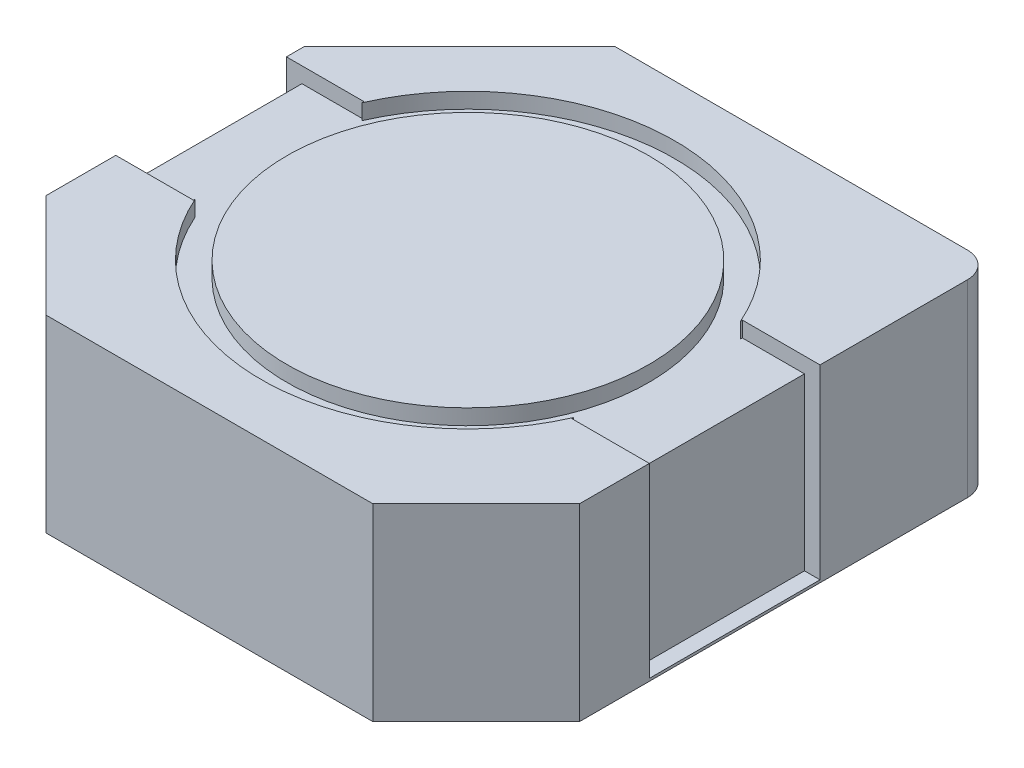
ISO-10303-21;
HEADER;
FILE_DESCRIPTION(('STEP AP214'),'2;1');
FILE_NAME('part.step','',(''),(''),'','','');
FILE_SCHEMA(('AUTOMOTIVE_DESIGN { 1 0 10303 214 1 1 1 1 }'));
ENDSEC;
DATA;
#1=APPLICATION_CONTEXT('core data for automotive mechanical design processes');
#2=APPLICATION_PROTOCOL_DEFINITION('international standard','automotive_design',2000,#1);
#3=PRODUCT_CONTEXT('',#1,'mechanical');
#4=PRODUCT('Part','Part','',(#3));
#5=PRODUCT_RELATED_PRODUCT_CATEGORY('part','',(#4));
#6=PRODUCT_DEFINITION_FORMATION('','',#4);
#7=PRODUCT_DEFINITION_CONTEXT('part definition',#1,'design');
#8=PRODUCT_DEFINITION('design','',#6,#7);
#9=PRODUCT_DEFINITION_SHAPE('','',#8);
#10=(LENGTH_UNIT() NAMED_UNIT(*) SI_UNIT(.MILLI.,.METRE.));
#11=(NAMED_UNIT(*) PLANE_ANGLE_UNIT() SI_UNIT($,.RADIAN.));
#12=(NAMED_UNIT(*) SI_UNIT($,.STERADIAN.) SOLID_ANGLE_UNIT());
#13=UNCERTAINTY_MEASURE_WITH_UNIT(LENGTH_MEASURE(1.E-05),#10,'distance_accuracy_value','');
#14=(GEOMETRIC_REPRESENTATION_CONTEXT(3) GLOBAL_UNCERTAINTY_ASSIGNED_CONTEXT((#13)) GLOBAL_UNIT_ASSIGNED_CONTEXT((#10,
#11,#12)) REPRESENTATION_CONTEXT('',''));
#15=CARTESIAN_POINT('',(0.,0.,0.));
#16=DIRECTION('',(0.,0.,1.));
#17=DIRECTION('',(1.,0.,0.));
#18=AXIS2_PLACEMENT_3D('',#15,#16,#17);
#19=CARTESIAN_POINT('',(24.13,5.17,5.7));
#20=DIRECTION('',(0.,1.,0.));
#21=DIRECTION('',(0.,0.,1.));
#22=AXIS2_PLACEMENT_3D('',#19,#20,#21);
#23=PLANE('',#22);
#24=CARTESIAN_POINT('',(24.13,5.17,5.7));
#25=DIRECTION('',(0.,-1.,0.));
#26=DIRECTION('',(0.,0.,-1.));
#27=AXIS2_PLACEMENT_3D('',#24,#25,#26);
#28=CIRCLE('',#27,3.5);
#29=CARTESIAN_POINT('',(24.13,5.17,2.2));
#30=VERTEX_POINT('',#29);
#31=EDGE_CURVE('E20',#30,#30,#28,.T.);
#32=ORIENTED_EDGE('',*,*,#31,.F.);
#33=EDGE_LOOP('',(#32));
#34=FACE_BOUND('',#33,.T.);
#35=ADVANCED_FACE('F17',(#34),#23,.T.);
#36=CARTESIAN_POINT('',(24.13,5.17,5.7));
#37=DIRECTION('',(0.,-1.,0.));
#38=DIRECTION('',(0.,0.,-1.));
#39=AXIS2_PLACEMENT_3D('',#36,#37,#38);
#40=CYLINDRICAL_SURFACE('',#39,3.5);
#41=CARTESIAN_POINT('',(24.13,4.87,5.7));
#42=DIRECTION('',(0.,-1.,0.));
#43=DIRECTION('',(0.,0.,-1.));
#44=AXIS2_PLACEMENT_3D('',#41,#42,#43);
#45=CIRCLE('',#44,3.5);
#46=CARTESIAN_POINT('',(24.13,4.87,2.2));
#47=VERTEX_POINT('',#46);
#48=EDGE_CURVE('E189',#47,#47,#45,.T.);
#49=ORIENTED_EDGE('',*,*,#48,.F.);
#50=EDGE_LOOP('',(#49));
#51=FACE_BOUND('',#50,.T.);
#52=ORIENTED_EDGE('',*,*,#31,.T.);
#53=EDGE_LOOP('',(#52));
#54=FACE_BOUND('',#53,.T.);
#55=ADVANCED_FACE('F730',(#51,#54),#40,.T.);
#56=CARTESIAN_POINT('',(27.79,5.17,7.35));
#57=DIRECTION('',(-1.,0.,0.));
#58=DIRECTION('',(0.,0.,1.));
#59=AXIS2_PLACEMENT_3D('',#56,#57,#58);
#60=PLANE('',#59);
#61=DIRECTION('',(0.,0.,1.));
#62=VECTOR('',#61,1.);
#63=CARTESIAN_POINT('',(27.79,4.87,5.7));
#64=LINE('',#63,#62);
#65=CARTESIAN_POINT('',(27.79,4.87,4.05));
#66=VERTEX_POINT('',#65);
#67=CARTESIAN_POINT('',(27.7899999999999,4.87,4.08618464501027));
#68=VERTEX_POINT('',#67);
#69=EDGE_CURVE('E174',#66,#68,#64,.T.);
#70=ORIENTED_EDGE('',*,*,#69,.F.);
#71=DIRECTION('',(0.,1.,0.));
#72=VECTOR('',#71,1.);
#73=CARTESIAN_POINT('',(27.79,5.17,4.05));
#74=LINE('',#73,#72);
#75=CARTESIAN_POINT('',(27.79,5.17,4.05));
#76=VERTEX_POINT('',#75);
#77=EDGE_CURVE('E233',#66,#76,#74,.T.);
#78=ORIENTED_EDGE('',*,*,#77,.T.);
#79=DIRECTION('',(0.,0.,1.));
#80=VECTOR('',#79,1.);
#81=CARTESIAN_POINT('',(27.79,5.17,7.35));
#82=LINE('',#81,#80);
#83=CARTESIAN_POINT('',(27.7899999999999,5.17,4.08618464501027));
#84=VERTEX_POINT('',#83);
#85=EDGE_CURVE('E254',#84,#76,#82,.F.);
#86=ORIENTED_EDGE('',*,*,#85,.F.);
#87=DIRECTION('',(0.,-1.,0.));
#88=VECTOR('',#87,1.);
#89=CARTESIAN_POINT('',(27.7899999999998,5.17,4.08618464501008));
#90=LINE('',#89,#88);
#91=EDGE_CURVE('E201',#84,#68,#90,.T.);
#92=ORIENTED_EDGE('',*,*,#91,.T.);
#93=EDGE_LOOP('',(#70,#78,#86,#92));
#94=FACE_BOUND('',#93,.T.);
#95=ADVANCED_FACE('F369',(#94),#60,.F.);
#96=CARTESIAN_POINT('',(27.79,5.17,7.35));
#97=DIRECTION('',(-1.,0.,0.));
#98=DIRECTION('',(0.,0.,1.));
#99=AXIS2_PLACEMENT_3D('',#96,#97,#98);
#100=PLANE('',#99);
#101=DIRECTION('',(0.,0.,1.));
#102=VECTOR('',#101,1.);
#103=CARTESIAN_POINT('',(27.79,5.17,7.35));
#104=LINE('',#103,#102);
#105=CARTESIAN_POINT('',(27.79,5.17,7.35));
#106=VERTEX_POINT('',#105);
#107=CARTESIAN_POINT('',(27.7899999999999,5.17,7.31381535498973));
#108=VERTEX_POINT('',#107);
#109=EDGE_CURVE('E251',#106,#108,#104,.F.);
#110=ORIENTED_EDGE('',*,*,#109,.F.);
#111=DIRECTION('',(0.,1.,0.));
#112=VECTOR('',#111,1.);
#113=CARTESIAN_POINT('',(27.79,5.17,7.35));
#114=LINE('',#113,#112);
#115=CARTESIAN_POINT('',(27.79,4.87,7.35));
#116=VERTEX_POINT('',#115);
#117=EDGE_CURVE('E245',#106,#116,#114,.F.);
#118=ORIENTED_EDGE('',*,*,#117,.T.);
#119=DIRECTION('',(0.,0.,1.));
#120=VECTOR('',#119,1.);
#121=CARTESIAN_POINT('',(27.79,4.87,5.7));
#122=LINE('',#121,#120);
#123=CARTESIAN_POINT('',(27.7899999999999,4.87,7.31381535498973));
#124=VERTEX_POINT('',#123);
#125=EDGE_CURVE('E220',#124,#116,#122,.T.);
#126=ORIENTED_EDGE('',*,*,#125,.F.);
#127=DIRECTION('',(0.,-1.,0.));
#128=VECTOR('',#127,1.);
#129=CARTESIAN_POINT('',(27.7899999999998,5.17,7.31381535498992));
#130=LINE('',#129,#128);
#131=EDGE_CURVE('E355',#124,#108,#130,.F.);
#132=ORIENTED_EDGE('',*,*,#131,.T.);
#133=EDGE_LOOP('',(#110,#118,#126,#132));
#134=FACE_BOUND('',#133,.T.);
#135=ADVANCED_FACE('F713',(#134),#100,.F.);
#136=CARTESIAN_POINT('',(28.99,3.22,5.7));
#137=DIRECTION('',(-1.,0.,0.));
#138=DIRECTION('',(0.,0.,1.));
#139=AXIS2_PLACEMENT_3D('',#136,#137,#138);
#140=PLANE('',#139);
#141=DIRECTION('',(0.,1.,0.));
#142=VECTOR('',#141,1.);
#143=CARTESIAN_POINT('',(28.99,5.17,4.05));
#144=LINE('',#143,#142);
#145=CARTESIAN_POINT('',(28.99,1.57,4.05));
#146=VERTEX_POINT('',#145);
#147=CARTESIAN_POINT('',(28.99,4.87,4.05));
#148=VERTEX_POINT('',#147);
#149=EDGE_CURVE('E257',#146,#148,#144,.T.);
#150=ORIENTED_EDGE('',*,*,#149,.T.);
#151=DIRECTION('',(0.,0.,1.));
#152=VECTOR('',#151,1.);
#153=CARTESIAN_POINT('',(28.99,4.87,5.7));
#154=LINE('',#153,#152);
#155=CARTESIAN_POINT('',(28.99,4.87,7.35));
#156=VERTEX_POINT('',#155);
#157=EDGE_CURVE('E217',#156,#148,#154,.F.);
#158=ORIENTED_EDGE('',*,*,#157,.F.);
#159=DIRECTION('',(0.,1.,0.));
#160=VECTOR('',#159,1.);
#161=CARTESIAN_POINT('',(28.99,5.17,7.35));
#162=LINE('',#161,#160);
#163=CARTESIAN_POINT('',(28.99,1.57,7.35));
#164=VERTEX_POINT('',#163);
#165=EDGE_CURVE('E236',#156,#164,#162,.F.);
#166=ORIENTED_EDGE('',*,*,#165,.T.);
#167=DIRECTION('',(0.,0.,-1.));
#168=VECTOR('',#167,1.);
#169=CARTESIAN_POINT('',(28.99,1.57,4.05));
#170=LINE('',#169,#168);
#171=EDGE_CURVE('E229',#164,#146,#170,.T.);
#172=ORIENTED_EDGE('',*,*,#171,.T.);
#173=EDGE_LOOP('',(#150,#158,#166,#172));
#174=FACE_BOUND('',#173,.T.);
#175=ADVANCED_FACE('F704',(#174),#140,.F.);
#176=CARTESIAN_POINT('',(20.47,5.17,4.05));
#177=DIRECTION('',(1.,0.,0.));
#178=DIRECTION('',(0.,0.,-1.));
#179=AXIS2_PLACEMENT_3D('',#176,#177,#178);
#180=PLANE('',#179);
#181=DIRECTION('',(0.,0.,1.));
#182=VECTOR('',#181,1.);
#183=CARTESIAN_POINT('',(20.47,4.87,5.7));
#184=LINE('',#183,#182);
#185=CARTESIAN_POINT('',(20.47,4.87,7.35));
#186=VERTEX_POINT('',#185);
#187=CARTESIAN_POINT('',(20.4700000000001,4.87,7.31381535498973));
#188=VERTEX_POINT('',#187);
#189=EDGE_CURVE('E222',#186,#188,#184,.F.);
#190=ORIENTED_EDGE('',*,*,#189,.F.);
#191=DIRECTION('',(0.,1.,0.));
#192=VECTOR('',#191,1.);
#193=CARTESIAN_POINT('',(20.47,5.17,7.35));
#194=LINE('',#193,#192);
#195=CARTESIAN_POINT('',(20.47,5.17,7.35));
#196=VERTEX_POINT('',#195);
#197=EDGE_CURVE('E285',#186,#196,#194,.T.);
#198=ORIENTED_EDGE('',*,*,#197,.T.);
#199=DIRECTION('',(0.,0.,-1.));
#200=VECTOR('',#199,1.);
#201=CARTESIAN_POINT('',(20.47,5.17,4.05));
#202=LINE('',#201,#200);
#203=CARTESIAN_POINT('',(20.4700000000001,5.17,7.31381535498973));
#204=VERTEX_POINT('',#203);
#205=EDGE_CURVE('E253',#204,#196,#202,.F.);
#206=ORIENTED_EDGE('',*,*,#205,.F.);
#207=DIRECTION('',(0.,-1.,0.));
#208=VECTOR('',#207,1.);
#209=CARTESIAN_POINT('',(20.4700000000002,5.17,7.31381535498992));
#210=LINE('',#209,#208);
#211=EDGE_CURVE('E261',#204,#188,#210,.T.);
#212=ORIENTED_EDGE('',*,*,#211,.T.);
#213=EDGE_LOOP('',(#190,#198,#206,#212));
#214=FACE_BOUND('',#213,.T.);
#215=ADVANCED_FACE('F696',(#214),#180,.F.);
#216=CARTESIAN_POINT('',(20.47,5.17,4.05));
#217=DIRECTION('',(1.,0.,0.));
#218=DIRECTION('',(0.,0.,-1.));
#219=AXIS2_PLACEMENT_3D('',#216,#217,#218);
#220=PLANE('',#219);
#221=DIRECTION('',(0.,0.,-1.));
#222=VECTOR('',#221,1.);
#223=CARTESIAN_POINT('',(20.47,5.17,4.05));
#224=LINE('',#223,#222);
#225=CARTESIAN_POINT('',(20.47,5.17,4.05));
#226=VERTEX_POINT('',#225);
#227=CARTESIAN_POINT('',(20.4700000000001,5.17,4.08618464501027));
#228=VERTEX_POINT('',#227);
#229=EDGE_CURVE('E226',#226,#228,#224,.F.);
#230=ORIENTED_EDGE('',*,*,#229,.F.);
#231=DIRECTION('',(0.,1.,0.));
#232=VECTOR('',#231,1.);
#233=CARTESIAN_POINT('',(20.47,5.17,4.05));
#234=LINE('',#233,#232);
#235=CARTESIAN_POINT('',(20.47,4.87,4.05));
#236=VERTEX_POINT('',#235);
#237=EDGE_CURVE('E186',#226,#236,#234,.F.);
#238=ORIENTED_EDGE('',*,*,#237,.T.);
#239=DIRECTION('',(0.,0.,1.));
#240=VECTOR('',#239,1.);
#241=CARTESIAN_POINT('',(20.47,4.87,5.7));
#242=LINE('',#241,#240);
#243=CARTESIAN_POINT('',(20.4700000000001,4.87,4.08618464501027));
#244=VERTEX_POINT('',#243);
#245=EDGE_CURVE('E180',#244,#236,#242,.F.);
#246=ORIENTED_EDGE('',*,*,#245,.F.);
#247=DIRECTION('',(0.,-1.,0.));
#248=VECTOR('',#247,1.);
#249=CARTESIAN_POINT('',(20.4700000000002,5.17,4.08618464501008));
#250=LINE('',#249,#248);
#251=EDGE_CURVE('E183',#244,#228,#250,.F.);
#252=ORIENTED_EDGE('',*,*,#251,.T.);
#253=EDGE_LOOP('',(#230,#238,#246,#252));
#254=FACE_BOUND('',#253,.T.);
#255=ADVANCED_FACE('F182',(#254),#220,.F.);
#256=CARTESIAN_POINT('',(24.13,4.87,5.7));
#257=DIRECTION('',(0.,1.,0.));
#258=DIRECTION('',(0.,0.,1.));
#259=AXIS2_PLACEMENT_3D('',#256,#257,#258);
#260=PLANE('',#259);
#261=ORIENTED_EDGE('',*,*,#48,.T.);
#262=EDGE_LOOP('',(#261));
#263=FACE_BOUND('',#262,.T.);
#264=ORIENTED_EDGE('',*,*,#245,.T.);
#265=DIRECTION('',(-1.,0.,0.));
#266=VECTOR('',#265,1.);
#267=CARTESIAN_POINT('',(18.97,4.87,4.05));
#268=LINE('',#267,#266);
#269=CARTESIAN_POINT('',(19.27,4.87,4.05));
#270=VERTEX_POINT('',#269);
#271=EDGE_CURVE('E276',#236,#270,#268,.T.);
#272=ORIENTED_EDGE('',*,*,#271,.T.);
#273=DIRECTION('',(0.,0.,-1.));
#274=VECTOR('',#273,1.);
#275=CARTESIAN_POINT('',(19.27,4.87,5.7));
#276=LINE('',#275,#274);
#277=CARTESIAN_POINT('',(19.27,4.87,7.35));
#278=VERTEX_POINT('',#277);
#279=EDGE_CURVE('E203',#270,#278,#276,.F.);
#280=ORIENTED_EDGE('',*,*,#279,.T.);
#281=DIRECTION('',(1.,0.,0.));
#282=VECTOR('',#281,1.);
#283=CARTESIAN_POINT('',(20.47,4.87,7.35));
#284=LINE('',#283,#282);
#285=EDGE_CURVE('E289',#278,#186,#284,.T.);
#286=ORIENTED_EDGE('',*,*,#285,.T.);
#287=ORIENTED_EDGE('',*,*,#189,.T.);
#288=CARTESIAN_POINT('',(24.13,4.87,5.7));
#289=DIRECTION('',(0.,-1.,0.));
#290=DIRECTION('',(0.,0.,-1.));
#291=AXIS2_PLACEMENT_3D('',#288,#289,#290);
#292=CIRCLE('',#291,4.);
#293=EDGE_CURVE('E198',#188,#124,#292,.F.);
#294=ORIENTED_EDGE('',*,*,#293,.T.);
#295=ORIENTED_EDGE('',*,*,#125,.T.);
#296=DIRECTION('',(1.,0.,0.));
#297=VECTOR('',#296,1.);
#298=CARTESIAN_POINT('',(29.29,4.87,7.35));
#299=LINE('',#298,#297);
#300=EDGE_CURVE('E240',#116,#156,#299,.T.);
#301=ORIENTED_EDGE('',*,*,#300,.T.);
#302=ORIENTED_EDGE('',*,*,#157,.T.);
#303=DIRECTION('',(-1.,0.,0.));
#304=VECTOR('',#303,1.);
#305=CARTESIAN_POINT('',(27.79,4.87,4.05));
#306=LINE('',#305,#304);
#307=EDGE_CURVE('E260',#148,#66,#306,.T.);
#308=ORIENTED_EDGE('',*,*,#307,.T.);
#309=ORIENTED_EDGE('',*,*,#69,.T.);
#310=CARTESIAN_POINT('',(24.13,4.87,5.7));
#311=DIRECTION('',(0.,-1.,0.));
#312=DIRECTION('',(0.,0.,-1.));
#313=AXIS2_PLACEMENT_3D('',#310,#311,#312);
#314=CIRCLE('',#313,4.);
#315=EDGE_CURVE('E194',#68,#244,#314,.F.);
#316=ORIENTED_EDGE('',*,*,#315,.T.);
#317=EDGE_LOOP('',(#264,#272,#280,#286,#287,#294,#295,#301,#302,#308,#309,#316));
#318=FACE_BOUND('',#317,.T.);
#319=ADVANCED_FACE('F200',(#263,#318),#260,.T.);
#320=CARTESIAN_POINT('',(19.27,3.22,5.7));
#321=DIRECTION('',(1.,0.,0.));
#322=DIRECTION('',(0.,0.,-1.));
#323=AXIS2_PLACEMENT_3D('',#320,#321,#322);
#324=PLANE('',#323);
#325=DIRECTION('',(0.,1.,0.));
#326=VECTOR('',#325,1.);
#327=CARTESIAN_POINT('',(19.27,5.17,7.35));
#328=LINE('',#327,#326);
#329=CARTESIAN_POINT('',(19.27,1.57,7.35));
#330=VERTEX_POINT('',#329);
#331=EDGE_CURVE('E293',#330,#278,#328,.T.);
#332=ORIENTED_EDGE('',*,*,#331,.T.);
#333=ORIENTED_EDGE('',*,*,#279,.F.);
#334=DIRECTION('',(0.,1.,0.));
#335=VECTOR('',#334,1.);
#336=CARTESIAN_POINT('',(19.27,5.17,4.05));
#337=LINE('',#336,#335);
#338=CARTESIAN_POINT('',(19.27,1.57,4.05));
#339=VERTEX_POINT('',#338);
#340=EDGE_CURVE('E278',#270,#339,#337,.F.);
#341=ORIENTED_EDGE('',*,*,#340,.T.);
#342=DIRECTION('',(0.,0.,-1.));
#343=VECTOR('',#342,1.);
#344=CARTESIAN_POINT('',(19.27,1.57,7.35));
#345=LINE('',#344,#343);
#346=EDGE_CURVE('E288',#339,#330,#345,.F.);
#347=ORIENTED_EDGE('',*,*,#346,.T.);
#348=EDGE_LOOP('',(#332,#333,#341,#347));
#349=FACE_BOUND('',#348,.T.);
#350=ADVANCED_FACE('F506',(#349),#324,.F.);
#351=CARTESIAN_POINT('',(24.13,5.17,5.7));
#352=DIRECTION('',(0.,-1.,0.));
#353=DIRECTION('',(0.,0.,-1.));
#354=AXIS2_PLACEMENT_3D('',#351,#352,#353);
#355=CYLINDRICAL_SURFACE('',#354,4.);
#356=ORIENTED_EDGE('',*,*,#315,.F.);
#357=ORIENTED_EDGE('',*,*,#91,.F.);
#358=CARTESIAN_POINT('',(24.13,5.17,5.7));
#359=DIRECTION('',(0.,-1.,0.));
#360=DIRECTION('',(0.,0.,-1.));
#361=AXIS2_PLACEMENT_3D('',#358,#359,#360);
#362=CIRCLE('',#361,4.);
#363=EDGE_CURVE('E197',#228,#84,#362,.T.);
#364=ORIENTED_EDGE('',*,*,#363,.F.);
#365=ORIENTED_EDGE('',*,*,#251,.F.);
#366=EDGE_LOOP('',(#356,#357,#364,#365));
#367=FACE_BOUND('',#366,.T.);
#368=ADVANCED_FACE('F192',(#367),#355,.F.);
#369=CARTESIAN_POINT('',(24.13,5.17,5.7));
#370=DIRECTION('',(0.,-1.,0.));
#371=DIRECTION('',(0.,0.,-1.));
#372=AXIS2_PLACEMENT_3D('',#369,#370,#371);
#373=CYLINDRICAL_SURFACE('',#372,4.);
#374=CARTESIAN_POINT('',(24.13,5.17,5.7));
#375=DIRECTION('',(0.,-1.,0.));
#376=DIRECTION('',(0.,0.,-1.));
#377=AXIS2_PLACEMENT_3D('',#374,#375,#376);
#378=CIRCLE('',#377,4.);
#379=EDGE_CURVE('E317',#108,#204,#378,.T.);
#380=ORIENTED_EDGE('',*,*,#379,.F.);
#381=ORIENTED_EDGE('',*,*,#131,.F.);
#382=ORIENTED_EDGE('',*,*,#293,.F.);
#383=ORIENTED_EDGE('',*,*,#211,.F.);
#384=EDGE_LOOP('',(#380,#381,#382,#383));
#385=FACE_BOUND('',#384,.T.);
#386=ADVANCED_FACE('F659',(#385),#373,.F.);
#387=CARTESIAN_POINT('',(27.79,5.17,4.05));
#388=DIRECTION('',(0.,0.,-1.));
#389=DIRECTION('',(-1.,0.,0.));
#390=AXIS2_PLACEMENT_3D('',#387,#388,#389);
#391=PLANE('',#390);
#392=ORIENTED_EDGE('',*,*,#77,.F.);
#393=ORIENTED_EDGE('',*,*,#307,.F.);
#394=ORIENTED_EDGE('',*,*,#149,.F.);
#395=DIRECTION('',(1.,0.,0.));
#396=VECTOR('',#395,1.);
#397=CARTESIAN_POINT('',(29.29,1.57,4.05));
#398=LINE('',#397,#396);
#399=CARTESIAN_POINT('',(29.29,1.57,4.05));
#400=VERTEX_POINT('',#399);
#401=EDGE_CURVE('E232',#146,#400,#398,.T.);
#402=ORIENTED_EDGE('',*,*,#401,.T.);
#403=DIRECTION('',(0.,1.,0.));
#404=VECTOR('',#403,1.);
#405=CARTESIAN_POINT('',(29.29,1.52,4.05));
#406=LINE('',#405,#404);
#407=CARTESIAN_POINT('',(29.29,5.17,4.05));
#408=VERTEX_POINT('',#407);
#409=EDGE_CURVE('E319',#408,#400,#406,.F.);
#410=ORIENTED_EDGE('',*,*,#409,.F.);
#411=DIRECTION('',(1.,0.,0.));
#412=VECTOR('',#411,1.);
#413=CARTESIAN_POINT('',(24.13,5.17,4.05));
#414=LINE('',#413,#412);
#415=EDGE_CURVE('E305',#76,#408,#414,.T.);
#416=ORIENTED_EDGE('',*,*,#415,.F.);
#417=EDGE_LOOP('',(#392,#393,#394,#402,#410,#416));
#418=FACE_BOUND('',#417,.T.);
#419=ADVANCED_FACE('F373',(#418),#391,.F.);
#420=CARTESIAN_POINT('',(29.29,1.57,4.05));
#421=DIRECTION('',(0.,-1.,0.));
#422=DIRECTION('',(0.,0.,-1.));
#423=AXIS2_PLACEMENT_3D('',#420,#421,#422);
#424=PLANE('',#423);
#425=ORIENTED_EDGE('',*,*,#401,.F.);
#426=ORIENTED_EDGE('',*,*,#171,.F.);
#427=DIRECTION('',(1.,0.,0.));
#428=VECTOR('',#427,1.);
#429=CARTESIAN_POINT('',(29.29,1.57,7.35));
#430=LINE('',#429,#428);
#431=CARTESIAN_POINT('',(29.29,1.57,7.35));
#432=VERTEX_POINT('',#431);
#433=EDGE_CURVE('E239',#164,#432,#430,.T.);
#434=ORIENTED_EDGE('',*,*,#433,.T.);
#435=DIRECTION('',(0.,0.,-1.));
#436=VECTOR('',#435,1.);
#437=CARTESIAN_POINT('',(29.29,1.57,8.7));
#438=LINE('',#437,#436);
#439=EDGE_CURVE('E332',#400,#432,#438,.F.);
#440=ORIENTED_EDGE('',*,*,#439,.F.);
#441=EDGE_LOOP('',(#425,#426,#434,#440));
#442=FACE_BOUND('',#441,.T.);
#443=ADVANCED_FACE('F642',(#442),#424,.F.);
#444=CARTESIAN_POINT('',(29.29,5.17,7.35));
#445=DIRECTION('',(0.,0.,1.));
#446=DIRECTION('',(1.,0.,0.));
#447=AXIS2_PLACEMENT_3D('',#444,#445,#446);
#448=PLANE('',#447);
#449=DIRECTION('',(0.,1.,0.));
#450=VECTOR('',#449,1.);
#451=CARTESIAN_POINT('',(29.29,1.52,7.35));
#452=LINE('',#451,#450);
#453=CARTESIAN_POINT('',(29.29,5.17,7.35));
#454=VERTEX_POINT('',#453);
#455=EDGE_CURVE('E339',#432,#454,#452,.T.);
#456=ORIENTED_EDGE('',*,*,#455,.F.);
#457=ORIENTED_EDGE('',*,*,#433,.F.);
#458=ORIENTED_EDGE('',*,*,#165,.F.);
#459=ORIENTED_EDGE('',*,*,#300,.F.);
#460=ORIENTED_EDGE('',*,*,#117,.F.);
#461=DIRECTION('',(1.,0.,0.));
#462=VECTOR('',#461,1.);
#463=CARTESIAN_POINT('',(24.13,5.17,7.35));
#464=LINE('',#463,#462);
#465=EDGE_CURVE('E304',#454,#106,#464,.F.);
#466=ORIENTED_EDGE('',*,*,#465,.F.);
#467=EDGE_LOOP('',(#456,#457,#458,#459,#460,#466));
#468=FACE_BOUND('',#467,.T.);
#469=ADVANCED_FACE('F521',(#468),#448,.F.);
#470=CARTESIAN_POINT('',(20.47,5.17,7.35));
#471=DIRECTION('',(0.,0.,1.));
#472=DIRECTION('',(1.,0.,0.));
#473=AXIS2_PLACEMENT_3D('',#470,#471,#472);
#474=PLANE('',#473);
#475=ORIENTED_EDGE('',*,*,#197,.F.);
#476=ORIENTED_EDGE('',*,*,#285,.F.);
#477=ORIENTED_EDGE('',*,*,#331,.F.);
#478=DIRECTION('',(1.,0.,0.));
#479=VECTOR('',#478,1.);
#480=CARTESIAN_POINT('',(18.97,1.57,7.35));
#481=LINE('',#480,#479);
#482=CARTESIAN_POINT('',(18.97,1.57,7.35));
#483=VERTEX_POINT('',#482);
#484=EDGE_CURVE('E282',#330,#483,#481,.F.);
#485=ORIENTED_EDGE('',*,*,#484,.T.);
#486=DIRECTION('',(0.,1.,0.));
#487=VECTOR('',#486,1.);
#488=CARTESIAN_POINT('',(18.97,1.52,7.35));
#489=LINE('',#488,#487);
#490=CARTESIAN_POINT('',(18.97,5.17,7.35));
#491=VERTEX_POINT('',#490);
#492=EDGE_CURVE('E431',#491,#483,#489,.F.);
#493=ORIENTED_EDGE('',*,*,#492,.F.);
#494=DIRECTION('',(1.,0.,0.));
#495=VECTOR('',#494,1.);
#496=CARTESIAN_POINT('',(24.13,5.17,7.35));
#497=LINE('',#496,#495);
#498=EDGE_CURVE('E302',#196,#491,#497,.F.);
#499=ORIENTED_EDGE('',*,*,#498,.F.);
#500=EDGE_LOOP('',(#475,#476,#477,#485,#493,#499));
#501=FACE_BOUND('',#500,.T.);
#502=ADVANCED_FACE('F510',(#501),#474,.F.);
#503=CARTESIAN_POINT('',(18.97,1.57,7.35));
#504=DIRECTION('',(0.,-1.,0.));
#505=DIRECTION('',(0.,0.,-1.));
#506=AXIS2_PLACEMENT_3D('',#503,#504,#505);
#507=PLANE('',#506);
#508=ORIENTED_EDGE('',*,*,#484,.F.);
#509=ORIENTED_EDGE('',*,*,#346,.F.);
#510=DIRECTION('',(-1.,0.,0.));
#511=VECTOR('',#510,1.);
#512=CARTESIAN_POINT('',(18.97,1.57,4.05));
#513=LINE('',#512,#511);
#514=CARTESIAN_POINT('',(18.97,1.57,4.05));
#515=VERTEX_POINT('',#514);
#516=EDGE_CURVE('E299',#339,#515,#513,.T.);
#517=ORIENTED_EDGE('',*,*,#516,.T.);
#518=DIRECTION('',(0.,0.,1.));
#519=VECTOR('',#518,1.);
#520=CARTESIAN_POINT('',(18.97,1.57,3.7));
#521=LINE('',#520,#519);
#522=EDGE_CURVE('E440',#483,#515,#521,.F.);
#523=ORIENTED_EDGE('',*,*,#522,.F.);
#524=EDGE_LOOP('',(#508,#509,#517,#523));
#525=FACE_BOUND('',#524,.T.);
#526=ADVANCED_FACE('F512',(#525),#507,.F.);
#527=CARTESIAN_POINT('',(18.97,5.17,4.05));
#528=DIRECTION('',(0.,0.,-1.));
#529=DIRECTION('',(-1.,0.,0.));
#530=AXIS2_PLACEMENT_3D('',#527,#528,#529);
#531=PLANE('',#530);
#532=DIRECTION('',(0.,1.,0.));
#533=VECTOR('',#532,1.);
#534=CARTESIAN_POINT('',(18.97,1.52,4.05));
#535=LINE('',#534,#533);
#536=CARTESIAN_POINT('',(18.97,5.17,4.05));
#537=VERTEX_POINT('',#536);
#538=EDGE_CURVE('E392',#515,#537,#535,.T.);
#539=ORIENTED_EDGE('',*,*,#538,.F.);
#540=ORIENTED_EDGE('',*,*,#516,.F.);
#541=ORIENTED_EDGE('',*,*,#340,.F.);
#542=ORIENTED_EDGE('',*,*,#271,.F.);
#543=ORIENTED_EDGE('',*,*,#237,.F.);
#544=DIRECTION('',(1.,0.,0.));
#545=VECTOR('',#544,1.);
#546=CARTESIAN_POINT('',(24.13,5.17,4.05));
#547=LINE('',#546,#545);
#548=EDGE_CURVE('E296',#537,#226,#547,.T.);
#549=ORIENTED_EDGE('',*,*,#548,.F.);
#550=EDGE_LOOP('',(#539,#540,#541,#542,#543,#549));
#551=FACE_BOUND('',#550,.T.);
#552=ADVANCED_FACE('F503',(#551),#531,.F.);
#553=CARTESIAN_POINT('',(24.13,5.17,5.7));
#554=DIRECTION('',(0.,1.,0.));
#555=DIRECTION('',(0.,0.,1.));
#556=AXIS2_PLACEMENT_3D('',#553,#554,#555);
#557=PLANE('',#556);
#558=DIRECTION('',(-0.707106781186548,0.,0.707106781186548));
#559=VECTOR('',#558,1.);
#560=CARTESIAN_POINT('',(21.97,5.17,0.7));
#561=LINE('',#560,#559);
#562=CARTESIAN_POINT('',(18.97,5.17,3.7));
#563=VERTEX_POINT('',#562);
#564=CARTESIAN_POINT('',(21.97,5.17,0.7));
#565=VERTEX_POINT('',#564);
#566=EDGE_CURVE('E395',#563,#565,#561,.F.);
#567=ORIENTED_EDGE('',*,*,#566,.F.);
#568=DIRECTION('',(0.,0.,1.));
#569=VECTOR('',#568,1.);
#570=CARTESIAN_POINT('',(18.97,5.17,3.7));
#571=LINE('',#570,#569);
#572=EDGE_CURVE('E388',#537,#563,#571,.F.);
#573=ORIENTED_EDGE('',*,*,#572,.F.);
#574=ORIENTED_EDGE('',*,*,#548,.T.);
#575=ORIENTED_EDGE('',*,*,#229,.T.);
#576=ORIENTED_EDGE('',*,*,#363,.T.);
#577=ORIENTED_EDGE('',*,*,#85,.T.);
#578=ORIENTED_EDGE('',*,*,#415,.T.);
#579=DIRECTION('',(0.,0.,-1.));
#580=VECTOR('',#579,1.);
#581=CARTESIAN_POINT('',(29.29,5.17,8.7));
#582=LINE('',#581,#580);
#583=CARTESIAN_POINT('',(29.29,5.17,1.2));
#584=VERTEX_POINT('',#583);
#585=EDGE_CURVE('E316',#584,#408,#582,.F.);
#586=ORIENTED_EDGE('',*,*,#585,.F.);
#587=CARTESIAN_POINT('',(28.79,5.17,1.2));
#588=DIRECTION('',(0.,1.,0.));
#589=DIRECTION('',(0.,0.,1.));
#590=AXIS2_PLACEMENT_3D('',#587,#588,#589);
#591=CIRCLE('',#590,0.5);
#592=CARTESIAN_POINT('',(28.79,5.17,0.7));
#593=VERTEX_POINT('',#592);
#594=EDGE_CURVE('E313',#593,#584,#591,.F.);
#595=ORIENTED_EDGE('',*,*,#594,.F.);
#596=DIRECTION('',(-1.,0.,0.));
#597=VECTOR('',#596,1.);
#598=CARTESIAN_POINT('',(28.79,5.17,0.7));
#599=LINE('',#598,#597);
#600=EDGE_CURVE('E401',#565,#593,#599,.F.);
#601=ORIENTED_EDGE('',*,*,#600,.F.);
#602=EDGE_LOOP('',(#567,#573,#574,#575,#576,#577,#578,#586,#595,#601));
#603=FACE_BOUND('',#602,.T.);
#604=ADVANCED_FACE('F496',(#603),#557,.T.);
#605=CARTESIAN_POINT('',(24.13,5.17,5.7));
#606=DIRECTION('',(0.,1.,0.));
#607=DIRECTION('',(0.,0.,1.));
#608=AXIS2_PLACEMENT_3D('',#605,#606,#607);
#609=PLANE('',#608);
#610=ORIENTED_EDGE('',*,*,#379,.T.);
#611=ORIENTED_EDGE('',*,*,#205,.T.);
#612=ORIENTED_EDGE('',*,*,#498,.T.);
#613=DIRECTION('',(0.,0.,1.));
#614=VECTOR('',#613,1.);
#615=CARTESIAN_POINT('',(18.97,5.17,3.7));
#616=LINE('',#615,#614);
#617=CARTESIAN_POINT('',(18.97,5.17,8.7));
#618=VERTEX_POINT('',#617);
#619=EDGE_CURVE('E387',#618,#491,#616,.F.);
#620=ORIENTED_EDGE('',*,*,#619,.F.);
#621=DIRECTION('',(0.707106781186548,0.,0.707106781186548));
#622=VECTOR('',#621,1.);
#623=CARTESIAN_POINT('',(18.97,5.17,8.7));
#624=LINE('',#623,#622);
#625=CARTESIAN_POINT('',(20.97,5.17,10.7));
#626=VERTEX_POINT('',#625);
#627=EDGE_CURVE('E445',#626,#618,#624,.F.);
#628=ORIENTED_EDGE('',*,*,#627,.F.);
#629=DIRECTION('',(1.,0.,0.));
#630=VECTOR('',#629,1.);
#631=CARTESIAN_POINT('',(20.97,5.17,10.7));
#632=LINE('',#631,#630);
#633=CARTESIAN_POINT('',(27.29,5.17,10.7));
#634=VERTEX_POINT('',#633);
#635=EDGE_CURVE('E449',#634,#626,#632,.F.);
#636=ORIENTED_EDGE('',*,*,#635,.F.);
#637=DIRECTION('',(0.707106781186548,0.,-0.707106781186548));
#638=VECTOR('',#637,1.);
#639=CARTESIAN_POINT('',(27.29,5.17,10.7));
#640=LINE('',#639,#638);
#641=CARTESIAN_POINT('',(29.29,5.17,8.7));
#642=VERTEX_POINT('',#641);
#643=EDGE_CURVE('E415',#642,#634,#640,.F.);
#644=ORIENTED_EDGE('',*,*,#643,.F.);
#645=DIRECTION('',(0.,0.,-1.));
#646=VECTOR('',#645,1.);
#647=CARTESIAN_POINT('',(29.29,5.17,8.7));
#648=LINE('',#647,#646);
#649=EDGE_CURVE('E341',#454,#642,#648,.F.);
#650=ORIENTED_EDGE('',*,*,#649,.F.);
#651=ORIENTED_EDGE('',*,*,#465,.T.);
#652=ORIENTED_EDGE('',*,*,#109,.T.);
#653=EDGE_LOOP('',(#610,#611,#612,#620,#628,#636,#644,#650,#651,#652));
#654=FACE_BOUND('',#653,.T.);
#655=ADVANCED_FACE('F545',(#654),#609,.T.);
#656=CARTESIAN_POINT('',(29.29,1.52,8.7));
#657=DIRECTION('',(1.,0.,0.));
#658=DIRECTION('',(0.,0.,-1.));
#659=AXIS2_PLACEMENT_3D('',#656,#657,#658);
#660=PLANE('',#659);
#661=DIRECTION('',(0.,1.,0.));
#662=VECTOR('',#661,1.);
#663=CARTESIAN_POINT('',(29.29,1.52,1.2));
#664=LINE('',#663,#662);
#665=CARTESIAN_POINT('',(29.29,1.52,1.2));
#666=VERTEX_POINT('',#665);
#667=EDGE_CURVE('E315',#584,#666,#664,.F.);
#668=ORIENTED_EDGE('',*,*,#667,.F.);
#669=ORIENTED_EDGE('',*,*,#585,.T.);
#670=ORIENTED_EDGE('',*,*,#409,.T.);
#671=ORIENTED_EDGE('',*,*,#439,.T.);
#672=ORIENTED_EDGE('',*,*,#455,.T.);
#673=ORIENTED_EDGE('',*,*,#649,.T.);
#674=DIRECTION('',(0.,1.,0.));
#675=VECTOR('',#674,1.);
#676=CARTESIAN_POINT('',(29.29,1.52,8.7));
#677=LINE('',#676,#675);
#678=CARTESIAN_POINT('',(29.29,1.52,8.7));
#679=VERTEX_POINT('',#678);
#680=EDGE_CURVE('E417',#679,#642,#677,.T.);
#681=ORIENTED_EDGE('',*,*,#680,.F.);
#682=DIRECTION('',(0.,0.,1.));
#683=VECTOR('',#682,1.);
#684=CARTESIAN_POINT('',(29.29,1.52,5.7));
#685=LINE('',#684,#683);
#686=EDGE_CURVE('E312',#679,#666,#685,.F.);
#687=ORIENTED_EDGE('',*,*,#686,.T.);
#688=EDGE_LOOP('',(#668,#669,#670,#671,#672,#673,#681,#687));
#689=FACE_BOUND('',#688,.T.);
#690=ADVANCED_FACE('F378',(#689),#660,.T.);
#691=CARTESIAN_POINT('',(28.79,1.52,1.2));
#692=DIRECTION('',(0.,1.,0.));
#693=DIRECTION('',(0.,0.,1.));
#694=AXIS2_PLACEMENT_3D('',#691,#692,#693);
#695=CYLINDRICAL_SURFACE('',#694,0.5);
#696=ORIENTED_EDGE('',*,*,#594,.T.);
#697=ORIENTED_EDGE('',*,*,#667,.T.);
#698=CARTESIAN_POINT('',(28.79,1.52,1.2));
#699=DIRECTION('',(0.,1.,0.));
#700=DIRECTION('',(0.,0.,1.));
#701=AXIS2_PLACEMENT_3D('',#698,#699,#700);
#702=CIRCLE('',#701,0.5);
#703=CARTESIAN_POINT('',(28.79,1.52,0.7));
#704=VERTEX_POINT('',#703);
#705=EDGE_CURVE('E308',#666,#704,#702,.T.);
#706=ORIENTED_EDGE('',*,*,#705,.T.);
#707=DIRECTION('',(0.,1.,0.));
#708=VECTOR('',#707,1.);
#709=CARTESIAN_POINT('',(28.79,1.52,0.7));
#710=LINE('',#709,#708);
#711=EDGE_CURVE('E398',#593,#704,#710,.F.);
#712=ORIENTED_EDGE('',*,*,#711,.F.);
#713=EDGE_LOOP('',(#696,#697,#706,#712));
#714=FACE_BOUND('',#713,.T.);
#715=ADVANCED_FACE('F495',(#714),#695,.T.);
#716=CARTESIAN_POINT('',(28.79,1.52,0.7));
#717=DIRECTION('',(0.,0.,-1.));
#718=DIRECTION('',(-1.,0.,0.));
#719=AXIS2_PLACEMENT_3D('',#716,#717,#718);
#720=PLANE('',#719);
#721=ORIENTED_EDGE('',*,*,#600,.T.);
#722=ORIENTED_EDGE('',*,*,#711,.T.);
#723=DIRECTION('',(1.,0.,0.));
#724=VECTOR('',#723,1.);
#725=CARTESIAN_POINT('',(24.13,1.52,0.7));
#726=LINE('',#725,#724);
#727=CARTESIAN_POINT('',(21.97,1.52,0.7));
#728=VERTEX_POINT('',#727);
#729=EDGE_CURVE('E311',#704,#728,#726,.F.);
#730=ORIENTED_EDGE('',*,*,#729,.T.);
#731=DIRECTION('',(0.,1.,0.));
#732=VECTOR('',#731,1.);
#733=CARTESIAN_POINT('',(21.97,1.52,0.7));
#734=LINE('',#733,#732);
#735=EDGE_CURVE('E397',#565,#728,#734,.F.);
#736=ORIENTED_EDGE('',*,*,#735,.F.);
#737=EDGE_LOOP('',(#721,#722,#730,#736));
#738=FACE_BOUND('',#737,.T.);
#739=ADVANCED_FACE('F491',(#738),#720,.T.);
#740=CARTESIAN_POINT('',(21.97,1.52,0.7));
#741=DIRECTION('',(-0.707106781186548,0.,-0.707106781186548));
#742=DIRECTION('',(-0.707106781186548,0.,0.707106781186548));
#743=AXIS2_PLACEMENT_3D('',#740,#741,#742);
#744=PLANE('',#743);
#745=ORIENTED_EDGE('',*,*,#566,.T.);
#746=ORIENTED_EDGE('',*,*,#735,.T.);
#747=DIRECTION('',(-0.707106781186547,0.,0.707106781186548));
#748=VECTOR('',#747,1.);
#749=CARTESIAN_POINT('',(21.97,1.52,0.7));
#750=LINE('',#749,#748);
#751=CARTESIAN_POINT('',(18.97,1.52,3.7));
#752=VERTEX_POINT('',#751);
#753=EDGE_CURVE('E434',#728,#752,#750,.T.);
#754=ORIENTED_EDGE('',*,*,#753,.T.);
#755=DIRECTION('',(0.,1.,0.));
#756=VECTOR('',#755,1.);
#757=CARTESIAN_POINT('',(18.97,1.52,3.7));
#758=LINE('',#757,#756);
#759=EDGE_CURVE('E385',#563,#752,#758,.F.);
#760=ORIENTED_EDGE('',*,*,#759,.F.);
#761=EDGE_LOOP('',(#745,#746,#754,#760));
#762=FACE_BOUND('',#761,.T.);
#763=ADVANCED_FACE('F486',(#762),#744,.T.);
#764=CARTESIAN_POINT('',(18.97,1.52,3.7));
#765=DIRECTION('',(-1.,0.,0.));
#766=DIRECTION('',(0.,0.,1.));
#767=AXIS2_PLACEMENT_3D('',#764,#765,#766);
#768=PLANE('',#767);
#769=DIRECTION('',(0.,1.,0.));
#770=VECTOR('',#769,1.);
#771=CARTESIAN_POINT('',(18.97,1.52,8.7));
#772=LINE('',#771,#770);
#773=CARTESIAN_POINT('',(18.97,1.52,8.7));
#774=VERTEX_POINT('',#773);
#775=EDGE_CURVE('E447',#618,#774,#772,.F.);
#776=ORIENTED_EDGE('',*,*,#775,.F.);
#777=ORIENTED_EDGE('',*,*,#619,.T.);
#778=ORIENTED_EDGE('',*,*,#492,.T.);
#779=ORIENTED_EDGE('',*,*,#522,.T.);
#780=ORIENTED_EDGE('',*,*,#538,.T.);
#781=ORIENTED_EDGE('',*,*,#572,.T.);
#782=ORIENTED_EDGE('',*,*,#759,.T.);
#783=DIRECTION('',(0.,0.,1.));
#784=VECTOR('',#783,1.);
#785=CARTESIAN_POINT('',(18.97,1.52,5.7));
#786=LINE('',#785,#784);
#787=EDGE_CURVE('E437',#752,#774,#786,.T.);
#788=ORIENTED_EDGE('',*,*,#787,.T.);
#789=EDGE_LOOP('',(#776,#777,#778,#779,#780,#781,#782,#788));
#790=FACE_BOUND('',#789,.T.);
#791=ADVANCED_FACE('F480',(#790),#768,.T.);
#792=CARTESIAN_POINT('',(18.97,1.52,8.7));
#793=DIRECTION('',(-0.707106781186548,0.,0.707106781186548));
#794=DIRECTION('',(0.707106781186548,0.,0.707106781186548));
#795=AXIS2_PLACEMENT_3D('',#792,#793,#794);
#796=PLANE('',#795);
#797=ORIENTED_EDGE('',*,*,#627,.T.);
#798=ORIENTED_EDGE('',*,*,#775,.T.);
#799=DIRECTION('',(0.707106781186547,0.,0.707106781186548));
#800=VECTOR('',#799,1.);
#801=CARTESIAN_POINT('',(18.97,1.52,8.7));
#802=LINE('',#801,#800);
#803=CARTESIAN_POINT('',(20.97,1.52,10.7));
#804=VERTEX_POINT('',#803);
#805=EDGE_CURVE('E462',#774,#804,#802,.T.);
#806=ORIENTED_EDGE('',*,*,#805,.T.);
#807=DIRECTION('',(0.,1.,0.));
#808=VECTOR('',#807,1.);
#809=CARTESIAN_POINT('',(20.97,1.52,10.7));
#810=LINE('',#809,#808);
#811=EDGE_CURVE('E426',#626,#804,#810,.F.);
#812=ORIENTED_EDGE('',*,*,#811,.F.);
#813=EDGE_LOOP('',(#797,#798,#806,#812));
#814=FACE_BOUND('',#813,.T.);
#815=ADVANCED_FACE('F475',(#814),#796,.T.);
#816=CARTESIAN_POINT('',(20.97,1.52,10.7));
#817=DIRECTION('',(0.,0.,1.));
#818=DIRECTION('',(1.,0.,0.));
#819=AXIS2_PLACEMENT_3D('',#816,#817,#818);
#820=PLANE('',#819);
#821=ORIENTED_EDGE('',*,*,#635,.T.);
#822=ORIENTED_EDGE('',*,*,#811,.T.);
#823=DIRECTION('',(1.,0.,0.));
#824=VECTOR('',#823,1.);
#825=CARTESIAN_POINT('',(24.13,1.52,10.7));
#826=LINE('',#825,#824);
#827=CARTESIAN_POINT('',(27.29,1.52,10.7));
#828=VERTEX_POINT('',#827);
#829=EDGE_CURVE('E26',#804,#828,#826,.T.);
#830=ORIENTED_EDGE('',*,*,#829,.T.);
#831=DIRECTION('',(0.,1.,0.));
#832=VECTOR('',#831,1.);
#833=CARTESIAN_POINT('',(27.29,1.52,10.7));
#834=LINE('',#833,#832);
#835=EDGE_CURVE('E34',#634,#828,#834,.F.);
#836=ORIENTED_EDGE('',*,*,#835,.F.);
#837=EDGE_LOOP('',(#821,#822,#830,#836));
#838=FACE_BOUND('',#837,.T.);
#839=ADVANCED_FACE('F468',(#838),#820,.T.);
#840=CARTESIAN_POINT('',(27.29,1.52,10.7));
#841=DIRECTION('',(0.707106781186548,0.,0.707106781186548));
#842=DIRECTION('',(0.707106781186548,0.,-0.707106781186548));
#843=AXIS2_PLACEMENT_3D('',#840,#841,#842);
#844=PLANE('',#843);
#845=ORIENTED_EDGE('',*,*,#643,.T.);
#846=ORIENTED_EDGE('',*,*,#835,.T.);
#847=DIRECTION('',(0.707106781186548,0.,-0.707106781186547));
#848=VECTOR('',#847,1.);
#849=CARTESIAN_POINT('',(27.29,1.52,10.7));
#850=LINE('',#849,#848);
#851=EDGE_CURVE('E11',#828,#679,#850,.T.);
#852=ORIENTED_EDGE('',*,*,#851,.T.);
#853=ORIENTED_EDGE('',*,*,#680,.T.);
#854=EDGE_LOOP('',(#845,#846,#852,#853));
#855=FACE_BOUND('',#854,.T.);
#856=ADVANCED_FACE('F524',(#855),#844,.T.);
#857=CARTESIAN_POINT('',(24.13,1.52,5.7));
#858=DIRECTION('',(0.,1.,0.));
#859=DIRECTION('',(0.,0.,1.));
#860=AXIS2_PLACEMENT_3D('',#857,#858,#859);
#861=PLANE('',#860);
#862=ORIENTED_EDGE('',*,*,#829,.F.);
#863=ORIENTED_EDGE('',*,*,#805,.F.);
#864=ORIENTED_EDGE('',*,*,#787,.F.);
#865=ORIENTED_EDGE('',*,*,#753,.F.);
#866=ORIENTED_EDGE('',*,*,#729,.F.);
#867=ORIENTED_EDGE('',*,*,#705,.F.);
#868=ORIENTED_EDGE('',*,*,#686,.F.);
#869=ORIENTED_EDGE('',*,*,#851,.F.);
#870=EDGE_LOOP('',(#862,#863,#864,#865,#866,#867,#868,#869));
#871=FACE_BOUND('',#870,.T.);
#872=ADVANCED_FACE('F472',(#871),#861,.F.);
#873=CLOSED_SHELL('',(#35,#55,#95,#135,#175,#215,#255,#319,#350,#368,#386,#419,#443,#469,#502,
#526,#552,#604,#655,#690,#715,#739,#763,#791,#815,#839,#856,#872));
#874=MANIFOLD_SOLID_BREP('B1',#873);
#875=ADVANCED_BREP_SHAPE_REPRESENTATION('',(#18,#874),#14);
#876=SHAPE_DEFINITION_REPRESENTATION(#9,#875);
ENDSEC;
END-ISO-10303-21;
